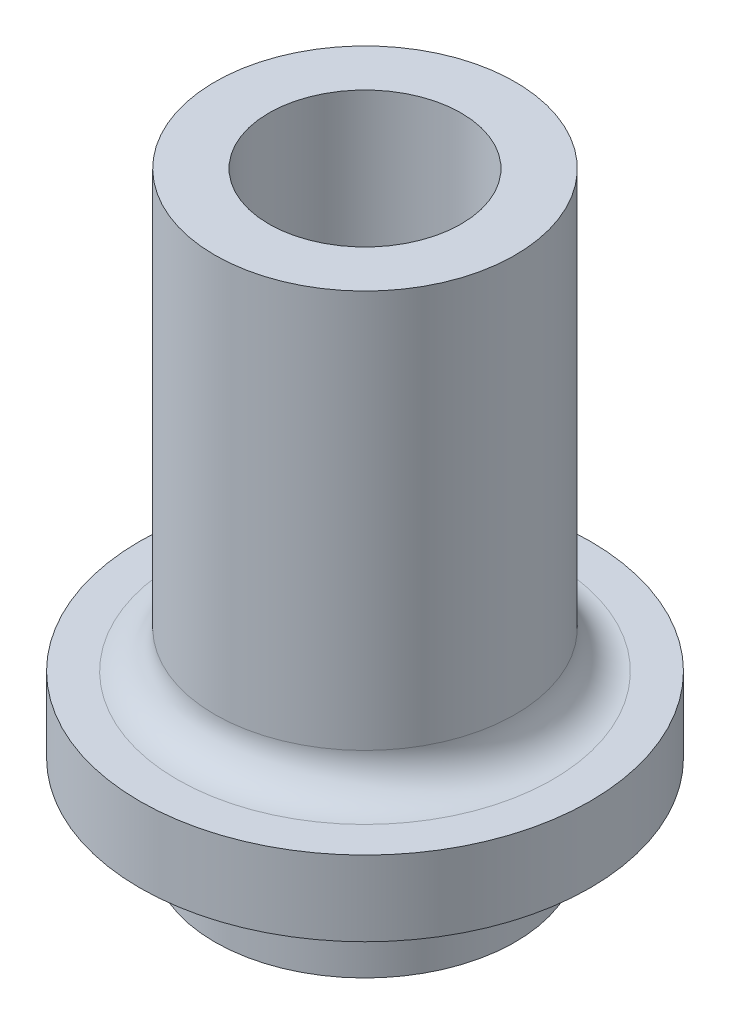
ISO-10303-21;
HEADER;
FILE_DESCRIPTION(('STEP AP214'),'2;1');
FILE_NAME('part.step','',(''),(''),'','','');
FILE_SCHEMA(('AUTOMOTIVE_DESIGN { 1 0 10303 214 1 1 1 1 }'));
ENDSEC;
DATA;
#1=APPLICATION_CONTEXT('core data for automotive mechanical design processes');
#2=APPLICATION_PROTOCOL_DEFINITION('international standard','automotive_design',2000,#1);
#3=PRODUCT_CONTEXT('',#1,'mechanical');
#4=PRODUCT('Part','Part','',(#3));
#5=PRODUCT_RELATED_PRODUCT_CATEGORY('part','',(#4));
#6=PRODUCT_DEFINITION_FORMATION('','',#4);
#7=PRODUCT_DEFINITION_CONTEXT('part definition',#1,'design');
#8=PRODUCT_DEFINITION('design','',#6,#7);
#9=PRODUCT_DEFINITION_SHAPE('','',#8);
#10=(LENGTH_UNIT() NAMED_UNIT(*) SI_UNIT(.MILLI.,.METRE.));
#11=(NAMED_UNIT(*) PLANE_ANGLE_UNIT() SI_UNIT($,.RADIAN.));
#12=(NAMED_UNIT(*) SI_UNIT($,.STERADIAN.) SOLID_ANGLE_UNIT());
#13=UNCERTAINTY_MEASURE_WITH_UNIT(LENGTH_MEASURE(1.E-05),#10,'distance_accuracy_value','');
#14=(GEOMETRIC_REPRESENTATION_CONTEXT(3) GLOBAL_UNCERTAINTY_ASSIGNED_CONTEXT((#13)) GLOBAL_UNIT_ASSIGNED_CONTEXT((#10,
#11,#12)) REPRESENTATION_CONTEXT('',''));
#15=CARTESIAN_POINT('',(0.,0.,0.));
#16=DIRECTION('',(0.,0.,1.));
#17=DIRECTION('',(1.,0.,0.));
#18=AXIS2_PLACEMENT_3D('',#15,#16,#17);
#19=CARTESIAN_POINT('',(0.,9.25,0.));
#20=DIRECTION('',(0.,-1.,0.));
#21=DIRECTION('',(0.,0.,-1.));
#22=AXIS2_PLACEMENT_3D('',#19,#20,#21);
#23=CYLINDRICAL_SURFACE('',#22,4.);
#24=CARTESIAN_POINT('',(0.,0.,0.));
#25=DIRECTION('',(0.,1.,0.));
#26=DIRECTION('',(0.,0.,1.));
#27=AXIS2_PLACEMENT_3D('',#24,#25,#26);
#28=CIRCLE('',#27,4.);
#29=CARTESIAN_POINT('',(0.,0.,4.));
#30=VERTEX_POINT('',#29);
#31=EDGE_CURVE('E74',#30,#30,#28,.T.);
#32=ORIENTED_EDGE('',*,*,#31,.T.);
#33=EDGE_LOOP('',(#32));
#34=FACE_BOUND('',#33,.T.);
#35=CARTESIAN_POINT('',(0.,2.24999999999894,0.));
#36=DIRECTION('',(0.,1.,0.));
#37=DIRECTION('',(0.,0.,1.));
#38=AXIS2_PLACEMENT_3D('',#35,#36,#37);
#39=CIRCLE('',#38,4.);
#40=CARTESIAN_POINT('',(0.,2.24999999999894,4.));
#41=VERTEX_POINT('',#40);
#42=EDGE_CURVE('E83',#41,#41,#39,.T.);
#43=ORIENTED_EDGE('',*,*,#42,.F.);
#44=EDGE_LOOP('',(#43));
#45=FACE_BOUND('',#44,.T.);
#46=ADVANCED_FACE('F33',(#34,#45),#23,.T.);
#47=CARTESIAN_POINT('',(0.,0.,0.));
#48=DIRECTION('',(0.,1.,0.));
#49=DIRECTION('',(0.,0.,1.));
#50=AXIS2_PLACEMENT_3D('',#47,#48,#49);
#51=PLANE('',#50);
#52=ORIENTED_EDGE('',*,*,#31,.F.);
#53=EDGE_LOOP('',(#52));
#54=FACE_BOUND('',#53,.T.);
#55=CARTESIAN_POINT('',(0.,0.,0.));
#56=DIRECTION('',(0.,1.,0.));
#57=DIRECTION('',(0.,0.,1.));
#58=AXIS2_PLACEMENT_3D('',#55,#56,#57);
#59=CIRCLE('',#58,1.54);
#60=CARTESIAN_POINT('',(-1.12,0.,-1.0569768209379));
#61=VERTEX_POINT('',#60);
#62=CARTESIAN_POINT('',(1.12,0.,-1.0569768209379));
#63=VERTEX_POINT('',#62);
#64=EDGE_CURVE('E71',#61,#63,#59,.T.);
#65=ORIENTED_EDGE('',*,*,#64,.T.);
#66=DIRECTION('',(-1.,0.,0.));
#67=VECTOR('',#66,1.);
#68=CARTESIAN_POINT('',(-1.12,0.,-1.0569768209379));
#69=LINE('',#68,#67);
#70=EDGE_CURVE('E64',#63,#61,#69,.T.);
#71=ORIENTED_EDGE('',*,*,#70,.T.);
#72=EDGE_LOOP('',(#65,#71));
#73=FACE_BOUND('',#72,.T.);
#74=ADVANCED_FACE('F102',(#54,#73),#51,.F.);
#75=CARTESIAN_POINT('',(0.,9.25,0.));
#76=DIRECTION('',(0.,-1.,0.));
#77=DIRECTION('',(0.,0.,-1.));
#78=AXIS2_PLACEMENT_3D('',#75,#76,#77);
#79=CYLINDRICAL_SURFACE('',#78,1.54);
#80=DIRECTION('',(0.,-1.,0.));
#81=VECTOR('',#80,1.);
#82=CARTESIAN_POINT('',(1.12,9.25,-1.0569768209379));
#83=LINE('',#82,#81);
#84=CARTESIAN_POINT('',(1.12,9.25,-1.0569768209379));
#85=VERTEX_POINT('',#84);
#86=EDGE_CURVE('E67',#85,#63,#83,.T.);
#87=ORIENTED_EDGE('',*,*,#86,.T.);
#88=ORIENTED_EDGE('',*,*,#64,.F.);
#89=DIRECTION('',(0.,-1.,0.));
#90=VECTOR('',#89,1.);
#91=CARTESIAN_POINT('',(-1.12,9.25,-1.0569768209379));
#92=LINE('',#91,#90);
#93=CARTESIAN_POINT('',(-1.12,9.25,-1.0569768209379));
#94=VERTEX_POINT('',#93);
#95=EDGE_CURVE('E54',#94,#61,#92,.T.);
#96=ORIENTED_EDGE('',*,*,#95,.F.);
#97=CARTESIAN_POINT('',(0.,9.25,0.));
#98=DIRECTION('',(0.,1.,0.));
#99=DIRECTION('',(0.,0.,1.));
#100=AXIS2_PLACEMENT_3D('',#97,#98,#99);
#101=CIRCLE('',#100,1.54);
#102=EDGE_CURVE('E61',#94,#85,#101,.T.);
#103=ORIENTED_EDGE('',*,*,#102,.T.);
#104=EDGE_LOOP('',(#87,#88,#96,#103));
#105=FACE_BOUND('',#104,.T.);
#106=ADVANCED_FACE('F69',(#105),#79,.F.);
#107=CARTESIAN_POINT('',(-1.12,9.25,-1.0569768209379));
#108=DIRECTION('',(0.,0.,1.));
#109=DIRECTION('',(1.,0.,0.));
#110=AXIS2_PLACEMENT_3D('',#107,#108,#109);
#111=PLANE('',#110);
#112=ORIENTED_EDGE('',*,*,#95,.T.);
#113=ORIENTED_EDGE('',*,*,#70,.F.);
#114=ORIENTED_EDGE('',*,*,#86,.F.);
#115=DIRECTION('',(-1.,0.,0.));
#116=VECTOR('',#115,1.);
#117=CARTESIAN_POINT('',(-1.12,9.25,-1.0569768209379));
#118=LINE('',#117,#116);
#119=EDGE_CURVE('E47',#85,#94,#118,.T.);
#120=ORIENTED_EDGE('',*,*,#119,.T.);
#121=EDGE_LOOP('',(#112,#113,#114,#120));
#122=FACE_BOUND('',#121,.T.);
#123=ADVANCED_FACE('F66',(#122),#111,.T.);
#124=CARTESIAN_POINT('',(0.,9.25,0.));
#125=DIRECTION('',(0.,1.,0.));
#126=DIRECTION('',(0.,0.,1.));
#127=AXIS2_PLACEMENT_3D('',#124,#125,#126);
#128=PLANE('',#127);
#129=ORIENTED_EDGE('',*,*,#119,.F.);
#130=ORIENTED_EDGE('',*,*,#102,.F.);
#131=EDGE_LOOP('',(#129,#130));
#132=FACE_BOUND('',#131,.T.);
#133=ADVANCED_FACE('F62',(#132),#128,.F.);
#134=CARTESIAN_POINT('',(0.,4.24999999999894,0.));
#135=DIRECTION('',(0.,1.,0.));
#136=DIRECTION('',(0.,0.,1.));
#137=AXIS2_PLACEMENT_3D('',#134,#135,#136);
#138=PLANE('',#137);
#139=CARTESIAN_POINT('',(0.,4.24999999999894,0.));
#140=DIRECTION('',(0.,1.,0.));
#141=DIRECTION('',(0.,0.,1.));
#142=AXIS2_PLACEMENT_3D('',#139,#140,#141);
#143=CIRCLE('',#142,5.);
#144=CARTESIAN_POINT('',(0.,4.24999999999894,5.));
#145=VERTEX_POINT('',#144);
#146=EDGE_CURVE('E11',#145,#145,#143,.F.);
#147=ORIENTED_EDGE('',*,*,#146,.T.);
#148=EDGE_LOOP('',(#147));
#149=FACE_BOUND('',#148,.T.);
#150=CARTESIAN_POINT('',(0.,4.24999999999894,0.));
#151=DIRECTION('',(0.,1.,0.));
#152=DIRECTION('',(0.,0.,1.));
#153=AXIS2_PLACEMENT_3D('',#150,#151,#152);
#154=CIRCLE('',#153,6.);
#155=CARTESIAN_POINT('',(0.,4.24999999999895,6.));
#156=VERTEX_POINT('',#155);
#157=EDGE_CURVE('E99',#156,#156,#154,.T.);
#158=ORIENTED_EDGE('',*,*,#157,.T.);
#159=EDGE_LOOP('',(#158));
#160=FACE_BOUND('',#159,.T.);
#161=ADVANCED_FACE('F147',(#149,#160),#138,.T.);
#162=CARTESIAN_POINT('',(0.,2.24999999999894,0.));
#163=DIRECTION('',(0.,1.,0.));
#164=DIRECTION('',(0.,0.,1.));
#165=AXIS2_PLACEMENT_3D('',#162,#163,#164);
#166=PLANE('',#165);
#167=CARTESIAN_POINT('',(0.,2.24999999999894,0.));
#168=DIRECTION('',(0.,1.,0.));
#169=DIRECTION('',(0.,0.,1.));
#170=AXIS2_PLACEMENT_3D('',#167,#168,#169);
#171=CIRCLE('',#170,6.);
#172=CARTESIAN_POINT('',(0.,2.24999999999895,6.));
#173=VERTEX_POINT('',#172);
#174=EDGE_CURVE('E93',#173,#173,#171,.T.);
#175=ORIENTED_EDGE('',*,*,#174,.F.);
#176=EDGE_LOOP('',(#175));
#177=FACE_BOUND('',#176,.T.);
#178=ORIENTED_EDGE('',*,*,#42,.T.);
#179=EDGE_LOOP('',(#178));
#180=FACE_BOUND('',#179,.T.);
#181=ADVANCED_FACE('F142',(#177,#180),#166,.F.);
#182=CARTESIAN_POINT('',(0.,4.24999999999894,0.));
#183=DIRECTION('',(0.,-1.,0.));
#184=DIRECTION('',(0.,0.,-1.));
#185=AXIS2_PLACEMENT_3D('',#182,#183,#184);
#186=CYLINDRICAL_SURFACE('',#185,6.);
#187=ORIENTED_EDGE('',*,*,#157,.F.);
#188=EDGE_LOOP('',(#187));
#189=FACE_BOUND('',#188,.T.);
#190=ORIENTED_EDGE('',*,*,#174,.T.);
#191=EDGE_LOOP('',(#190));
#192=FACE_BOUND('',#191,.T.);
#193=ADVANCED_FACE('F137',(#189,#192),#186,.T.);
#194=CARTESIAN_POINT('',(0.,10.25,0.));
#195=DIRECTION('',(0.,1.,0.));
#196=DIRECTION('',(0.,0.,1.));
#197=AXIS2_PLACEMENT_3D('',#194,#195,#196);
#198=PLANE('',#197);
#199=CARTESIAN_POINT('',(0.,10.25,0.));
#200=DIRECTION('',(0.,1.,0.));
#201=DIRECTION('',(0.,0.,1.));
#202=AXIS2_PLACEMENT_3D('',#199,#200,#201);
#203=CIRCLE('',#202,2.5625);
#204=CARTESIAN_POINT('',(0.,10.25,2.5625));
#205=VERTEX_POINT('',#204);
#206=EDGE_CURVE('E81',#205,#205,#203,.F.);
#207=ORIENTED_EDGE('',*,*,#206,.F.);
#208=EDGE_LOOP('',(#207));
#209=FACE_BOUND('',#208,.T.);
#210=ADVANCED_FACE('F132',(#209),#198,.T.);
#211=CARTESIAN_POINT('',(0.,15.85,0.));
#212=DIRECTION('',(0.,-1.,0.));
#213=DIRECTION('',(0.,0.,-1.));
#214=AXIS2_PLACEMENT_3D('',#211,#212,#213);
#215=CYLINDRICAL_SURFACE('',#214,2.5625);
#216=CARTESIAN_POINT('',(0.,15.85,0.));
#217=DIRECTION('',(0.,1.,0.));
#218=DIRECTION('',(0.,0.,1.));
#219=AXIS2_PLACEMENT_3D('',#216,#217,#218);
#220=CIRCLE('',#219,2.5625);
#221=CARTESIAN_POINT('',(0.,15.85,2.5625));
#222=VERTEX_POINT('',#221);
#223=EDGE_CURVE('E95',#222,#222,#220,.T.);
#224=ORIENTED_EDGE('',*,*,#223,.T.);
#225=EDGE_LOOP('',(#224));
#226=FACE_BOUND('',#225,.T.);
#227=ORIENTED_EDGE('',*,*,#206,.T.);
#228=EDGE_LOOP('',(#227));
#229=FACE_BOUND('',#228,.T.);
#230=ADVANCED_FACE('F122',(#226,#229),#215,.F.);
#231=CARTESIAN_POINT('',(0.,15.85,0.));
#232=DIRECTION('',(0.,1.,0.));
#233=DIRECTION('',(0.,0.,1.));
#234=AXIS2_PLACEMENT_3D('',#231,#232,#233);
#235=PLANE('',#234);
#236=CARTESIAN_POINT('',(0.,15.85,0.));
#237=DIRECTION('',(0.,1.,0.));
#238=DIRECTION('',(0.,0.,1.));
#239=AXIS2_PLACEMENT_3D('',#236,#237,#238);
#240=CIRCLE('',#239,4.);
#241=CARTESIAN_POINT('',(0.,15.85,4.));
#242=VERTEX_POINT('',#241);
#243=EDGE_CURVE('E98',#242,#242,#240,.T.);
#244=ORIENTED_EDGE('',*,*,#243,.T.);
#245=EDGE_LOOP('',(#244));
#246=FACE_BOUND('',#245,.T.);
#247=ORIENTED_EDGE('',*,*,#223,.F.);
#248=EDGE_LOOP('',(#247));
#249=FACE_BOUND('',#248,.T.);
#250=ADVANCED_FACE('F116',(#246,#249),#235,.T.);
#251=CARTESIAN_POINT('',(0.,5.24999999999894,0.));
#252=DIRECTION('',(0.,1.,0.));
#253=DIRECTION('',(0.,0.,1.));
#254=AXIS2_PLACEMENT_3D('',#251,#252,#253);
#255=CIRCLE('',#254,4.);
#256=CARTESIAN_POINT('',(0.,5.24999999999894,4.));
#257=VERTEX_POINT('',#256);
#258=EDGE_CURVE('E41',#257,#257,#255,.T.);
#259=ORIENTED_EDGE('',*,*,#258,.T.);
#260=EDGE_LOOP('',(#259));
#261=FACE_BOUND('',#260,.T.);
#262=ORIENTED_EDGE('',*,*,#243,.F.);
#263=EDGE_LOOP('',(#262));
#264=FACE_BOUND('',#263,.T.);
#265=ADVANCED_FACE('F112',(#261,#264),#23,.T.);
#266=CARTESIAN_POINT('',(0.,5.24999999999894,0.));
#267=DIRECTION('',(0.,1.,0.));
#268=DIRECTION('',(0.,0.,1.));
#269=AXIS2_PLACEMENT_3D('',#266,#267,#268);
#270=TOROIDAL_SURFACE('',#269,5.,1.);
#271=ORIENTED_EDGE('',*,*,#146,.F.);
#272=EDGE_LOOP('',(#271));
#273=FACE_BOUND('',#272,.T.);
#274=ORIENTED_EDGE('',*,*,#258,.F.);
#275=EDGE_LOOP('',(#274));
#276=FACE_BOUND('',#275,.T.);
#277=ADVANCED_FACE('F35',(#273,#276),#270,.F.);
#278=CLOSED_SHELL('',(#46,#74,#106,#123,#133,#161,#181,#193,#210,#230,#250,#265,#277));
#279=MANIFOLD_SOLID_BREP('B2',#278);
#280=ADVANCED_BREP_SHAPE_REPRESENTATION('',(#18,#279),#14);
#281=SHAPE_DEFINITION_REPRESENTATION(#9,#280);
ENDSEC;
END-ISO-10303-21;
